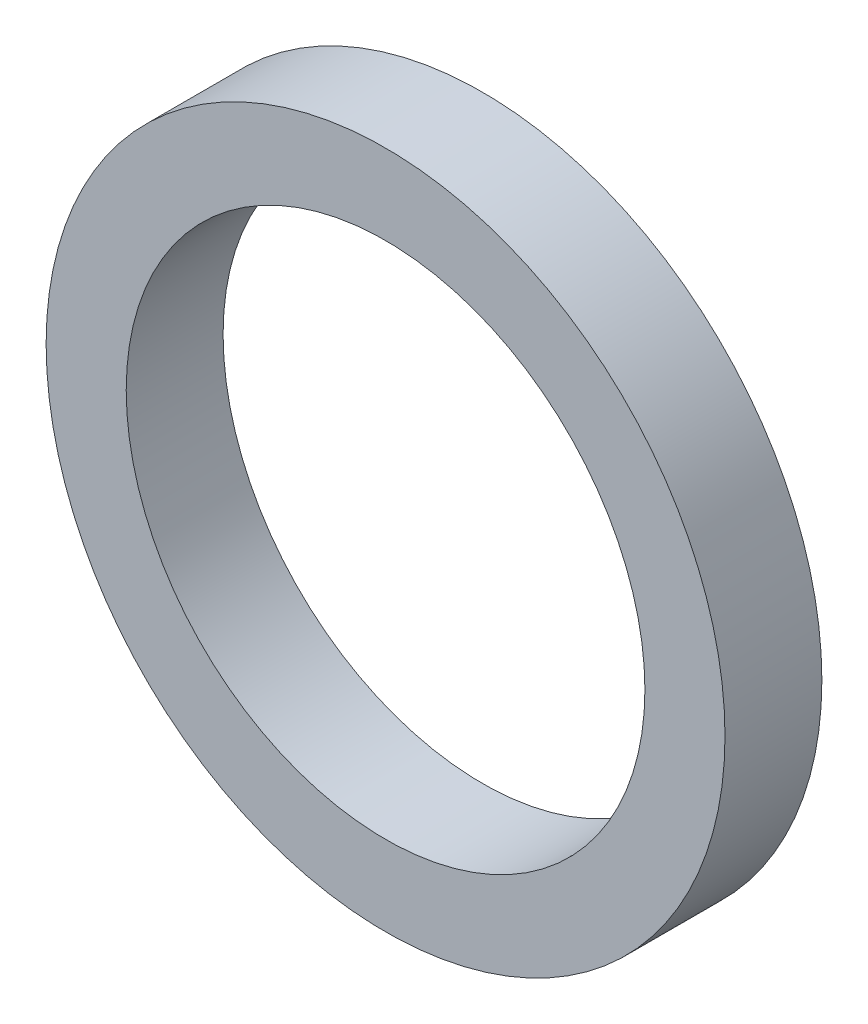
ISO-10303-21;
HEADER;
FILE_DESCRIPTION(('STEP AP214'),'2;1');
FILE_NAME('part.step','',(''),(''),'','','');
FILE_SCHEMA(('AUTOMOTIVE_DESIGN { 1 0 10303 214 1 1 1 1 }'));
ENDSEC;
DATA;
#1=APPLICATION_CONTEXT('core data for automotive mechanical design processes');
#2=APPLICATION_PROTOCOL_DEFINITION('international standard','automotive_design',2000,#1);
#3=PRODUCT_CONTEXT('',#1,'mechanical');
#4=PRODUCT('Part','Part','',(#3));
#5=PRODUCT_RELATED_PRODUCT_CATEGORY('part','',(#4));
#6=PRODUCT_DEFINITION_FORMATION('','',#4);
#7=PRODUCT_DEFINITION_CONTEXT('part definition',#1,'design');
#8=PRODUCT_DEFINITION('design','',#6,#7);
#9=PRODUCT_DEFINITION_SHAPE('','',#8);
#10=(LENGTH_UNIT() NAMED_UNIT(*) SI_UNIT(.MILLI.,.METRE.));
#11=(NAMED_UNIT(*) PLANE_ANGLE_UNIT() SI_UNIT($,.RADIAN.));
#12=(NAMED_UNIT(*) SI_UNIT($,.STERADIAN.) SOLID_ANGLE_UNIT());
#13=UNCERTAINTY_MEASURE_WITH_UNIT(LENGTH_MEASURE(1.E-05),#10,'distance_accuracy_value','');
#14=(GEOMETRIC_REPRESENTATION_CONTEXT(3) GLOBAL_UNCERTAINTY_ASSIGNED_CONTEXT((#13)) GLOBAL_UNIT_ASSIGNED_CONTEXT((#10,
#11,#12)) REPRESENTATION_CONTEXT('',''));
#15=CARTESIAN_POINT('',(0.,0.,0.));
#16=DIRECTION('',(0.,0.,1.));
#17=DIRECTION('',(1.,0.,0.));
#18=AXIS2_PLACEMENT_3D('',#15,#16,#17);
#19=CARTESIAN_POINT('',(0.,0.,38.1));
#20=DIRECTION('',(0.,0.,1.));
#21=DIRECTION('',(1.,0.,0.));
#22=AXIS2_PLACEMENT_3D('',#19,#20,#21);
#23=PLANE('',#22);
#24=CARTESIAN_POINT('',(0.,0.,38.1));
#25=DIRECTION('',(0.,0.,1.));
#26=DIRECTION('',(1.,0.,0.));
#27=AXIS2_PLACEMENT_3D('',#24,#25,#26);
#28=CIRCLE('',#27,133.5);
#29=CARTESIAN_POINT('',(133.5,0.,38.1));
#30=VERTEX_POINT('',#29);
#31=EDGE_CURVE('E10',#30,#30,#28,.T.);
#32=ORIENTED_EDGE('',*,*,#31,.T.);
#33=EDGE_LOOP('',(#32));
#34=FACE_BOUND('',#33,.T.);
#35=CARTESIAN_POINT('',(0.,0.,38.1));
#36=DIRECTION('',(0.,0.,1.));
#37=DIRECTION('',(1.,0.,0.));
#38=AXIS2_PLACEMENT_3D('',#35,#36,#37);
#39=CIRCLE('',#38,102.);
#40=CARTESIAN_POINT('',(102.,0.,38.1));
#41=VERTEX_POINT('',#40);
#42=EDGE_CURVE('E43',#41,#41,#39,.T.);
#43=ORIENTED_EDGE('',*,*,#42,.F.);
#44=EDGE_LOOP('',(#43));
#45=FACE_BOUND('',#44,.T.);
#46=ADVANCED_FACE('F32',(#34,#45),#23,.T.);
#47=CARTESIAN_POINT('',(0.,0.,0.));
#48=DIRECTION('',(0.,0.,1.));
#49=DIRECTION('',(1.,0.,0.));
#50=AXIS2_PLACEMENT_3D('',#47,#48,#49);
#51=PLANE('',#50);
#52=CARTESIAN_POINT('',(0.,0.,0.));
#53=DIRECTION('',(0.,0.,1.));
#54=DIRECTION('',(1.,0.,0.));
#55=AXIS2_PLACEMENT_3D('',#52,#53,#54);
#56=CIRCLE('',#55,133.5);
#57=CARTESIAN_POINT('',(133.5,0.,0.));
#58=VERTEX_POINT('',#57);
#59=EDGE_CURVE('E36',#58,#58,#56,.T.);
#60=ORIENTED_EDGE('',*,*,#59,.F.);
#61=EDGE_LOOP('',(#60));
#62=FACE_BOUND('',#61,.T.);
#63=CARTESIAN_POINT('',(0.,0.,0.));
#64=DIRECTION('',(0.,0.,1.));
#65=DIRECTION('',(1.,0.,0.));
#66=AXIS2_PLACEMENT_3D('',#63,#64,#65);
#67=CIRCLE('',#66,102.);
#68=CARTESIAN_POINT('',(102.,0.,0.));
#69=VERTEX_POINT('',#68);
#70=EDGE_CURVE('E45',#69,#69,#67,.T.);
#71=ORIENTED_EDGE('',*,*,#70,.T.);
#72=EDGE_LOOP('',(#71));
#73=FACE_BOUND('',#72,.T.);
#74=ADVANCED_FACE('F55',(#62,#73),#51,.F.);
#75=CARTESIAN_POINT('',(0.,0.,38.1));
#76=DIRECTION('',(0.,0.,-1.));
#77=DIRECTION('',(-1.,0.,0.));
#78=AXIS2_PLACEMENT_3D('',#75,#76,#77);
#79=CYLINDRICAL_SURFACE('',#78,133.5);
#80=ORIENTED_EDGE('',*,*,#31,.F.);
#81=EDGE_LOOP('',(#80));
#82=FACE_BOUND('',#81,.T.);
#83=ORIENTED_EDGE('',*,*,#59,.T.);
#84=EDGE_LOOP('',(#83));
#85=FACE_BOUND('',#84,.T.);
#86=ADVANCED_FACE('F34',(#82,#85),#79,.T.);
#87=CARTESIAN_POINT('',(0.,0.,38.1));
#88=DIRECTION('',(0.,0.,-1.));
#89=DIRECTION('',(-1.,0.,0.));
#90=AXIS2_PLACEMENT_3D('',#87,#88,#89);
#91=CYLINDRICAL_SURFACE('',#90,102.);
#92=ORIENTED_EDGE('',*,*,#42,.T.);
#93=EDGE_LOOP('',(#92));
#94=FACE_BOUND('',#93,.T.);
#95=ORIENTED_EDGE('',*,*,#70,.F.);
#96=EDGE_LOOP('',(#95));
#97=FACE_BOUND('',#96,.T.);
#98=ADVANCED_FACE('F51',(#94,#97),#91,.F.);
#99=CLOSED_SHELL('',(#46,#74,#86,#98));
#100=MANIFOLD_SOLID_BREP('B2',#99);
#101=ADVANCED_BREP_SHAPE_REPRESENTATION('',(#18,#100),#14);
#102=SHAPE_DEFINITION_REPRESENTATION(#9,#101);
ENDSEC;
END-ISO-10303-21;
